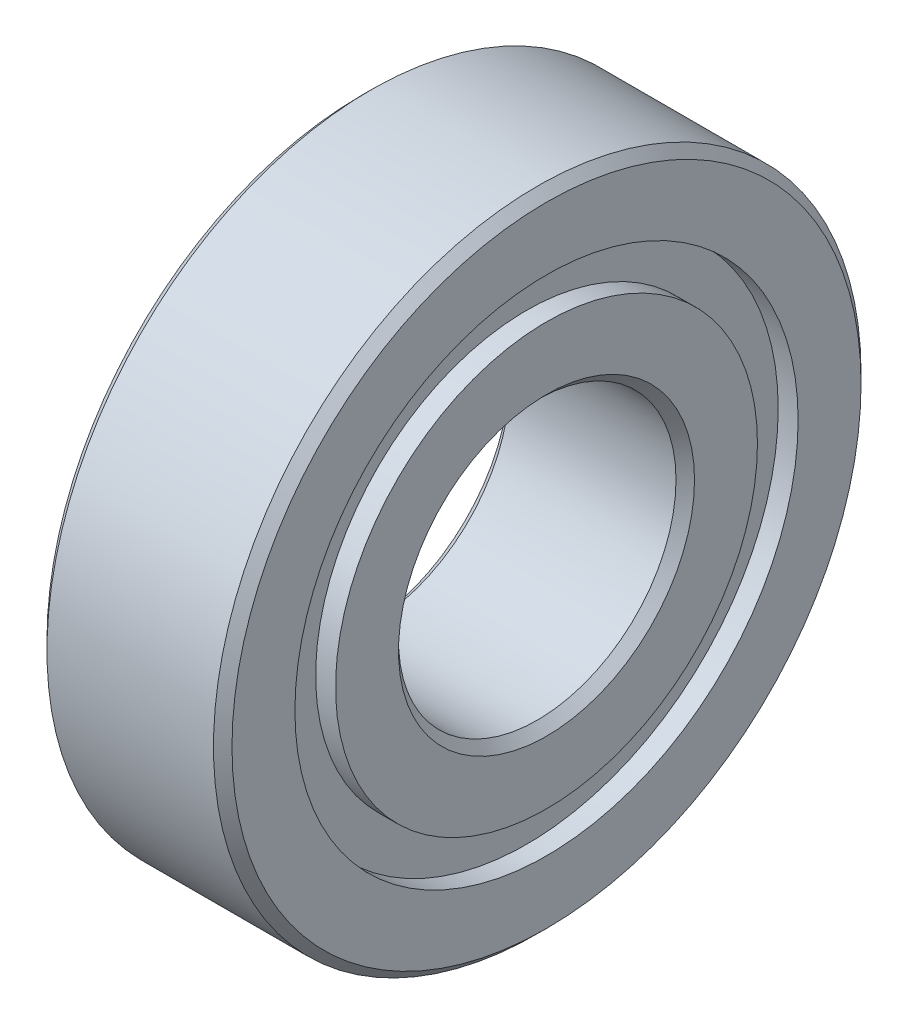
ISO-10303-21;
HEADER;
FILE_DESCRIPTION(('STEP AP214'),'2;1');
FILE_NAME('part.step','',(''),(''),'','','');
FILE_SCHEMA(('AUTOMOTIVE_DESIGN { 1 0 10303 214 1 1 1 1 }'));
ENDSEC;
DATA;
#1=APPLICATION_CONTEXT('core data for automotive mechanical design processes');
#2=APPLICATION_PROTOCOL_DEFINITION('international standard','automotive_design',2000,#1);
#3=PRODUCT_CONTEXT('',#1,'mechanical');
#4=PRODUCT('Part','Part','',(#3));
#5=PRODUCT_RELATED_PRODUCT_CATEGORY('part','',(#4));
#6=PRODUCT_DEFINITION_FORMATION('','',#4);
#7=PRODUCT_DEFINITION_CONTEXT('part definition',#1,'design');
#8=PRODUCT_DEFINITION('design','',#6,#7);
#9=PRODUCT_DEFINITION_SHAPE('','',#8);
#10=(LENGTH_UNIT() NAMED_UNIT(*) SI_UNIT(.MILLI.,.METRE.));
#11=(NAMED_UNIT(*) PLANE_ANGLE_UNIT() SI_UNIT($,.RADIAN.));
#12=(NAMED_UNIT(*) SI_UNIT($,.STERADIAN.) SOLID_ANGLE_UNIT());
#13=UNCERTAINTY_MEASURE_WITH_UNIT(LENGTH_MEASURE(1.E-05),#10,'distance_accuracy_value','');
#14=(GEOMETRIC_REPRESENTATION_CONTEXT(3) GLOBAL_UNCERTAINTY_ASSIGNED_CONTEXT((#13)) GLOBAL_UNIT_ASSIGNED_CONTEXT((#10,
#11,#12)) REPRESENTATION_CONTEXT('',''));
#15=CARTESIAN_POINT('',(0.,0.,0.));
#16=DIRECTION('',(0.,0.,1.));
#17=DIRECTION('',(1.,0.,0.));
#18=AXIS2_PLACEMENT_3D('',#15,#16,#17);
#19=CARTESIAN_POINT('',(4.,10.8791208791209,0.));
#20=DIRECTION('',(1.,0.,0.));
#21=DIRECTION('',(0.,0.,-1.));
#22=AXIS2_PLACEMENT_3D('',#19,#20,#21);
#23=PLANE('',#22);
#24=CARTESIAN_POINT('',(4.,0.,0.));
#25=DIRECTION('',(1.,0.,0.));
#26=DIRECTION('',(0.,0.,-1.));
#27=AXIS2_PLACEMENT_3D('',#24,#25,#26);
#28=CIRCLE('',#27,13.6);
#29=CARTESIAN_POINT('',(4.,0.,-13.6));
#30=VERTEX_POINT('',#29);
#31=EDGE_CURVE('E10',#30,#30,#28,.T.);
#32=ORIENTED_EDGE('',*,*,#31,.T.);
#33=EDGE_LOOP('',(#32));
#34=FACE_BOUND('',#33,.T.);
#35=CARTESIAN_POINT('',(4.,0.,0.));
#36=DIRECTION('',(1.,0.,0.));
#37=DIRECTION('',(0.,0.,-1.));
#38=AXIS2_PLACEMENT_3D('',#35,#36,#37);
#39=CIRCLE('',#38,10.8791208791209);
#40=CARTESIAN_POINT('',(4.,0.,-10.8791208791209));
#41=VERTEX_POINT('',#40);
#42=EDGE_CURVE('E88',#41,#41,#39,.T.);
#43=ORIENTED_EDGE('',*,*,#42,.F.);
#44=EDGE_LOOP('',(#43));
#45=FACE_BOUND('',#44,.T.);
#46=ADVANCED_FACE('F36',(#34,#45),#23,.T.);
#47=CARTESIAN_POINT('',(4.,0.,0.));
#48=DIRECTION('',(-1.,0.,0.));
#49=DIRECTION('',(0.,0.,1.));
#50=AXIS2_PLACEMENT_3D('',#47,#48,#49);
#51=CONICAL_SURFACE('',#50,13.6,0.785398163397462);
#52=CARTESIAN_POINT('',(3.60000000000001,0.,0.));
#53=DIRECTION('',(1.,0.,0.));
#54=DIRECTION('',(0.,0.,-1.));
#55=AXIS2_PLACEMENT_3D('',#52,#53,#54);
#56=CIRCLE('',#55,14.);
#57=CARTESIAN_POINT('',(3.60000000000001,0.,-14.));
#58=VERTEX_POINT('',#57);
#59=EDGE_CURVE('E42',#58,#58,#56,.T.);
#60=ORIENTED_EDGE('',*,*,#59,.T.);
#61=EDGE_LOOP('',(#60));
#62=FACE_BOUND('',#61,.T.);
#63=ORIENTED_EDGE('',*,*,#31,.F.);
#64=EDGE_LOOP('',(#63));
#65=FACE_BOUND('',#64,.T.);
#66=ADVANCED_FACE('F96',(#62,#65),#51,.T.);
#67=CARTESIAN_POINT('',(-4.,0.,0.));
#68=DIRECTION('',(1.,0.,0.));
#69=DIRECTION('',(0.,0.,-1.));
#70=AXIS2_PLACEMENT_3D('',#67,#68,#69);
#71=CYLINDRICAL_SURFACE('',#70,14.);
#72=CARTESIAN_POINT('',(-3.59999999999999,0.,0.));
#73=DIRECTION('',(1.,0.,0.));
#74=DIRECTION('',(0.,0.,-1.));
#75=AXIS2_PLACEMENT_3D('',#72,#73,#74);
#76=CIRCLE('',#75,14.);
#77=CARTESIAN_POINT('',(-3.59999999999999,0.,-14.));
#78=VERTEX_POINT('',#77);
#79=EDGE_CURVE('E46',#78,#78,#76,.T.);
#80=ORIENTED_EDGE('',*,*,#79,.T.);
#81=EDGE_LOOP('',(#80));
#82=FACE_BOUND('',#81,.T.);
#83=ORIENTED_EDGE('',*,*,#59,.F.);
#84=EDGE_LOOP('',(#83));
#85=FACE_BOUND('',#84,.T.);
#86=ADVANCED_FACE('F100',(#82,#85),#71,.T.);
#87=CARTESIAN_POINT('',(-3.59999999999999,0.,0.));
#88=DIRECTION('',(1.,0.,0.));
#89=DIRECTION('',(0.,0.,-1.));
#90=AXIS2_PLACEMENT_3D('',#87,#88,#89);
#91=CONICAL_SURFACE('',#90,14.,0.785398163397442);
#92=CARTESIAN_POINT('',(-4.,0.,0.));
#93=DIRECTION('',(1.,0.,0.));
#94=DIRECTION('',(0.,0.,-1.));
#95=AXIS2_PLACEMENT_3D('',#92,#93,#94);
#96=CIRCLE('',#95,13.6);
#97=CARTESIAN_POINT('',(-4.,0.,-13.6));
#98=VERTEX_POINT('',#97);
#99=EDGE_CURVE('E50',#98,#98,#96,.T.);
#100=ORIENTED_EDGE('',*,*,#99,.T.);
#101=EDGE_LOOP('',(#100));
#102=FACE_BOUND('',#101,.T.);
#103=ORIENTED_EDGE('',*,*,#79,.F.);
#104=EDGE_LOOP('',(#103));
#105=FACE_BOUND('',#104,.T.);
#106=ADVANCED_FACE('F104',(#102,#105),#91,.T.);
#107=CARTESIAN_POINT('',(-4.,13.6,0.));
#108=DIRECTION('',(-1.,0.,0.));
#109=DIRECTION('',(0.,0.,1.));
#110=AXIS2_PLACEMENT_3D('',#107,#108,#109);
#111=PLANE('',#110);
#112=CARTESIAN_POINT('',(-4.,0.,0.));
#113=DIRECTION('',(1.,0.,0.));
#114=DIRECTION('',(0.,0.,-1.));
#115=AXIS2_PLACEMENT_3D('',#112,#113,#114);
#116=CIRCLE('',#115,10.8791208791209);
#117=CARTESIAN_POINT('',(-4.,0.,-10.8791208791209));
#118=VERTEX_POINT('',#117);
#119=EDGE_CURVE('E55',#118,#118,#116,.T.);
#120=ORIENTED_EDGE('',*,*,#119,.T.);
#121=EDGE_LOOP('',(#120));
#122=FACE_BOUND('',#121,.T.);
#123=ORIENTED_EDGE('',*,*,#99,.F.);
#124=EDGE_LOOP('',(#123));
#125=FACE_BOUND('',#124,.T.);
#126=ADVANCED_FACE('F111',(#122,#125),#111,.T.);
#127=CARTESIAN_POINT('',(-4.,0.,0.));
#128=DIRECTION('',(1.,0.,0.));
#129=DIRECTION('',(0.,0.,-1.));
#130=AXIS2_PLACEMENT_3D('',#127,#128,#129);
#131=CYLINDRICAL_SURFACE('',#130,10.8791208791209);
#132=CARTESIAN_POINT('',(-3.13888889,0.,0.));
#133=DIRECTION('',(1.,0.,0.));
#134=DIRECTION('',(0.,0.,-1.));
#135=AXIS2_PLACEMENT_3D('',#132,#133,#134);
#136=CIRCLE('',#135,10.8791208791209);
#137=CARTESIAN_POINT('',(-3.13888889,0.,-10.8791208791209));
#138=VERTEX_POINT('',#137);
#139=EDGE_CURVE('E58',#138,#138,#136,.T.);
#140=ORIENTED_EDGE('',*,*,#139,.T.);
#141=EDGE_LOOP('',(#140));
#142=FACE_BOUND('',#141,.T.);
#143=ORIENTED_EDGE('',*,*,#119,.F.);
#144=EDGE_LOOP('',(#143));
#145=FACE_BOUND('',#144,.T.);
#146=ADVANCED_FACE('F115',(#142,#145),#131,.F.);
#147=CARTESIAN_POINT('',(-3.13888889,10.8791208791209,0.));
#148=DIRECTION('',(-1.,0.,0.));
#149=DIRECTION('',(0.,0.,1.));
#150=AXIS2_PLACEMENT_3D('',#147,#148,#149);
#151=PLANE('',#150);
#152=CARTESIAN_POINT('',(-3.13888889,0.,0.));
#153=DIRECTION('',(1.,0.,0.));
#154=DIRECTION('',(0.,0.,-1.));
#155=AXIS2_PLACEMENT_3D('',#152,#153,#154);
#156=CIRCLE('',#155,9.12087912087912);
#157=CARTESIAN_POINT('',(-3.13888889,0.,-9.12087912087912));
#158=VERTEX_POINT('',#157);
#159=EDGE_CURVE('E61',#158,#158,#156,.T.);
#160=ORIENTED_EDGE('',*,*,#159,.T.);
#161=EDGE_LOOP('',(#160));
#162=FACE_BOUND('',#161,.T.);
#163=ORIENTED_EDGE('',*,*,#139,.F.);
#164=EDGE_LOOP('',(#163));
#165=FACE_BOUND('',#164,.T.);
#166=ADVANCED_FACE('F119',(#162,#165),#151,.T.);
#167=CARTESIAN_POINT('',(-4.,0.,0.));
#168=DIRECTION('',(1.,0.,0.));
#169=DIRECTION('',(0.,0.,-1.));
#170=AXIS2_PLACEMENT_3D('',#167,#168,#169);
#171=CYLINDRICAL_SURFACE('',#170,9.12087912087912);
#172=CARTESIAN_POINT('',(-4.,0.,0.));
#173=DIRECTION('',(1.,0.,0.));
#174=DIRECTION('',(0.,0.,-1.));
#175=AXIS2_PLACEMENT_3D('',#172,#173,#174);
#176=CIRCLE('',#175,9.12087912087912);
#177=CARTESIAN_POINT('',(-4.,0.,-9.12087912087912));
#178=VERTEX_POINT('',#177);
#179=EDGE_CURVE('E64',#178,#178,#176,.T.);
#180=ORIENTED_EDGE('',*,*,#179,.T.);
#181=EDGE_LOOP('',(#180));
#182=FACE_BOUND('',#181,.T.);
#183=ORIENTED_EDGE('',*,*,#159,.F.);
#184=EDGE_LOOP('',(#183));
#185=FACE_BOUND('',#184,.T.);
#186=ADVANCED_FACE('F123',(#182,#185),#171,.T.);
#187=CARTESIAN_POINT('',(-4.,9.12087912087912,0.));
#188=DIRECTION('',(-1.,0.,0.));
#189=DIRECTION('',(0.,0.,1.));
#190=AXIS2_PLACEMENT_3D('',#187,#188,#189);
#191=PLANE('',#190);
#192=CARTESIAN_POINT('',(-4.,0.,0.));
#193=DIRECTION('',(1.,0.,0.));
#194=DIRECTION('',(0.,0.,-1.));
#195=AXIS2_PLACEMENT_3D('',#192,#193,#194);
#196=CIRCLE('',#195,6.39999999999999);
#197=CARTESIAN_POINT('',(-4.,0.,-6.39999999999999));
#198=VERTEX_POINT('',#197);
#199=EDGE_CURVE('E67',#198,#198,#196,.T.);
#200=ORIENTED_EDGE('',*,*,#199,.T.);
#201=EDGE_LOOP('',(#200));
#202=FACE_BOUND('',#201,.T.);
#203=ORIENTED_EDGE('',*,*,#179,.F.);
#204=EDGE_LOOP('',(#203));
#205=FACE_BOUND('',#204,.T.);
#206=ADVANCED_FACE('F127',(#202,#205),#191,.T.);
#207=CARTESIAN_POINT('',(-4.,0.,0.));
#208=DIRECTION('',(-1.,0.,0.));
#209=DIRECTION('',(0.,0.,1.));
#210=AXIS2_PLACEMENT_3D('',#207,#208,#209);
#211=CONICAL_SURFACE('',#210,6.39999999999999,0.785398163397435);
#212=CARTESIAN_POINT('',(-3.6,0.,0.));
#213=DIRECTION('',(1.,0.,0.));
#214=DIRECTION('',(0.,0.,-1.));
#215=AXIS2_PLACEMENT_3D('',#212,#213,#214);
#216=CIRCLE('',#215,6.);
#217=CARTESIAN_POINT('',(-3.6,0.,-6.));
#218=VERTEX_POINT('',#217);
#219=EDGE_CURVE('E70',#218,#218,#216,.T.);
#220=ORIENTED_EDGE('',*,*,#219,.T.);
#221=EDGE_LOOP('',(#220));
#222=FACE_BOUND('',#221,.T.);
#223=ORIENTED_EDGE('',*,*,#199,.F.);
#224=EDGE_LOOP('',(#223));
#225=FACE_BOUND('',#224,.T.);
#226=ADVANCED_FACE('F131',(#222,#225),#211,.F.);
#227=CARTESIAN_POINT('',(-4.,0.,0.));
#228=DIRECTION('',(1.,0.,0.));
#229=DIRECTION('',(0.,0.,-1.));
#230=AXIS2_PLACEMENT_3D('',#227,#228,#229);
#231=CYLINDRICAL_SURFACE('',#230,6.);
#232=CARTESIAN_POINT('',(3.6,0.,0.));
#233=DIRECTION('',(1.,0.,0.));
#234=DIRECTION('',(0.,0.,-1.));
#235=AXIS2_PLACEMENT_3D('',#232,#233,#234);
#236=CIRCLE('',#235,6.);
#237=CARTESIAN_POINT('',(3.6,0.,-6.));
#238=VERTEX_POINT('',#237);
#239=EDGE_CURVE('E73',#238,#238,#236,.T.);
#240=ORIENTED_EDGE('',*,*,#239,.T.);
#241=EDGE_LOOP('',(#240));
#242=FACE_BOUND('',#241,.T.);
#243=ORIENTED_EDGE('',*,*,#219,.F.);
#244=EDGE_LOOP('',(#243));
#245=FACE_BOUND('',#244,.T.);
#246=ADVANCED_FACE('F135',(#242,#245),#231,.F.);
#247=CARTESIAN_POINT('',(3.6,0.,0.));
#248=DIRECTION('',(1.,0.,0.));
#249=DIRECTION('',(0.,0.,-1.));
#250=AXIS2_PLACEMENT_3D('',#247,#248,#249);
#251=CONICAL_SURFACE('',#250,6.,0.785398163397466);
#252=CARTESIAN_POINT('',(4.,0.,0.));
#253=DIRECTION('',(1.,0.,0.));
#254=DIRECTION('',(0.,0.,-1.));
#255=AXIS2_PLACEMENT_3D('',#252,#253,#254);
#256=CIRCLE('',#255,6.40000000000001);
#257=CARTESIAN_POINT('',(4.,0.,-6.40000000000001));
#258=VERTEX_POINT('',#257);
#259=EDGE_CURVE('E76',#258,#258,#256,.T.);
#260=ORIENTED_EDGE('',*,*,#259,.T.);
#261=EDGE_LOOP('',(#260));
#262=FACE_BOUND('',#261,.T.);
#263=ORIENTED_EDGE('',*,*,#239,.F.);
#264=EDGE_LOOP('',(#263));
#265=FACE_BOUND('',#264,.T.);
#266=ADVANCED_FACE('F139',(#262,#265),#251,.F.);
#267=CARTESIAN_POINT('',(4.,6.40000000000001,0.));
#268=DIRECTION('',(1.,0.,0.));
#269=DIRECTION('',(0.,0.,-1.));
#270=AXIS2_PLACEMENT_3D('',#267,#268,#269);
#271=PLANE('',#270);
#272=CARTESIAN_POINT('',(4.,0.,0.));
#273=DIRECTION('',(1.,0.,0.));
#274=DIRECTION('',(0.,0.,-1.));
#275=AXIS2_PLACEMENT_3D('',#272,#273,#274);
#276=CIRCLE('',#275,9.12087912087912);
#277=CARTESIAN_POINT('',(4.,0.,-9.12087912087912));
#278=VERTEX_POINT('',#277);
#279=EDGE_CURVE('E79',#278,#278,#276,.T.);
#280=ORIENTED_EDGE('',*,*,#279,.T.);
#281=EDGE_LOOP('',(#280));
#282=FACE_BOUND('',#281,.T.);
#283=ORIENTED_EDGE('',*,*,#259,.F.);
#284=EDGE_LOOP('',(#283));
#285=FACE_BOUND('',#284,.T.);
#286=ADVANCED_FACE('F143',(#282,#285),#271,.T.);
#287=CARTESIAN_POINT('',(-4.,0.,0.));
#288=DIRECTION('',(1.,0.,0.));
#289=DIRECTION('',(0.,0.,-1.));
#290=AXIS2_PLACEMENT_3D('',#287,#288,#289);
#291=CYLINDRICAL_SURFACE('',#290,9.12087912087912);
#292=CARTESIAN_POINT('',(3.13888889,0.,0.));
#293=DIRECTION('',(1.,0.,0.));
#294=DIRECTION('',(0.,0.,-1.));
#295=AXIS2_PLACEMENT_3D('',#292,#293,#294);
#296=CIRCLE('',#295,9.12087912087912);
#297=CARTESIAN_POINT('',(3.13888889,0.,-9.12087912087912));
#298=VERTEX_POINT('',#297);
#299=EDGE_CURVE('E82',#298,#298,#296,.T.);
#300=ORIENTED_EDGE('',*,*,#299,.T.);
#301=EDGE_LOOP('',(#300));
#302=FACE_BOUND('',#301,.T.);
#303=ORIENTED_EDGE('',*,*,#279,.F.);
#304=EDGE_LOOP('',(#303));
#305=FACE_BOUND('',#304,.T.);
#306=ADVANCED_FACE('F147',(#302,#305),#291,.T.);
#307=CARTESIAN_POINT('',(3.13888889,9.12087912087912,0.));
#308=DIRECTION('',(1.,0.,0.));
#309=DIRECTION('',(0.,0.,-1.));
#310=AXIS2_PLACEMENT_3D('',#307,#308,#309);
#311=PLANE('',#310);
#312=CARTESIAN_POINT('',(3.13888889,0.,0.));
#313=DIRECTION('',(1.,0.,0.));
#314=DIRECTION('',(0.,0.,-1.));
#315=AXIS2_PLACEMENT_3D('',#312,#313,#314);
#316=CIRCLE('',#315,10.8791208791209);
#317=CARTESIAN_POINT('',(3.13888889,0.,-10.8791208791209));
#318=VERTEX_POINT('',#317);
#319=EDGE_CURVE('E85',#318,#318,#316,.T.);
#320=ORIENTED_EDGE('',*,*,#319,.T.);
#321=EDGE_LOOP('',(#320));
#322=FACE_BOUND('',#321,.T.);
#323=ORIENTED_EDGE('',*,*,#299,.F.);
#324=EDGE_LOOP('',(#323));
#325=FACE_BOUND('',#324,.T.);
#326=ADVANCED_FACE('F151',(#322,#325),#311,.T.);
#327=CARTESIAN_POINT('',(-4.,0.,0.));
#328=DIRECTION('',(1.,0.,0.));
#329=DIRECTION('',(0.,0.,-1.));
#330=AXIS2_PLACEMENT_3D('',#327,#328,#329);
#331=CYLINDRICAL_SURFACE('',#330,10.8791208791209);
#332=ORIENTED_EDGE('',*,*,#42,.T.);
#333=EDGE_LOOP('',(#332));
#334=FACE_BOUND('',#333,.T.);
#335=ORIENTED_EDGE('',*,*,#319,.F.);
#336=EDGE_LOOP('',(#335));
#337=FACE_BOUND('',#336,.T.);
#338=ADVANCED_FACE('F92',(#334,#337),#331,.F.);
#339=CLOSED_SHELL('',(#46,#66,#86,#106,#126,#146,#166,#186,#206,#226,#246,#266,#286,#306,#326,#338));
#340=MANIFOLD_SOLID_BREP('B2',#339);
#341=ADVANCED_BREP_SHAPE_REPRESENTATION('',(#18,#340),#14);
#342=SHAPE_DEFINITION_REPRESENTATION(#9,#341);
ENDSEC;
END-ISO-10303-21;
